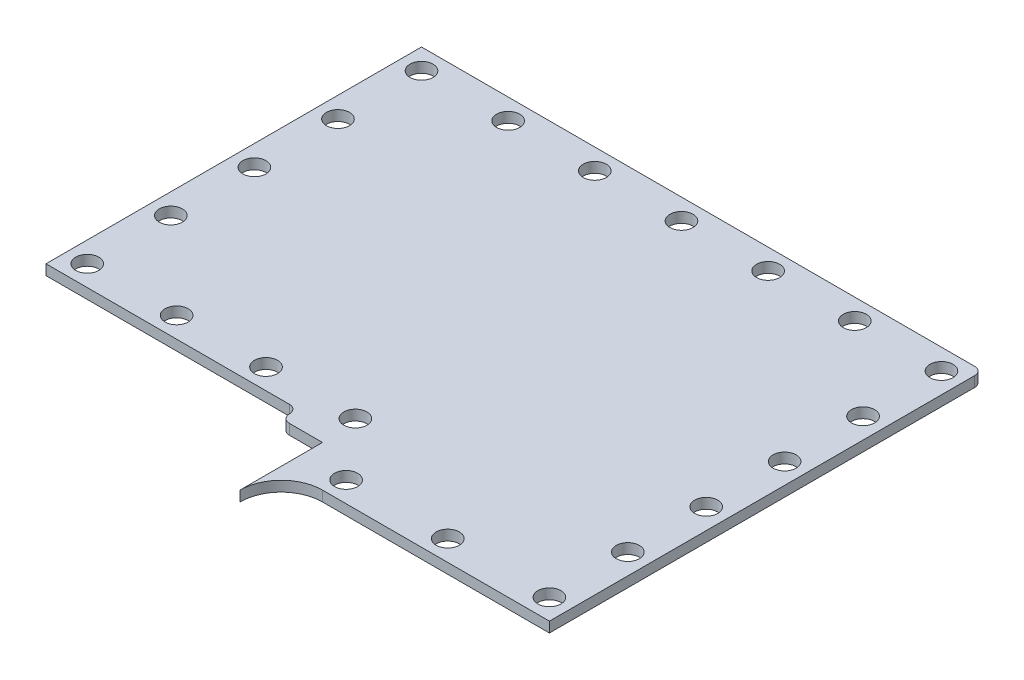
ISO-10303-21;
HEADER;
FILE_DESCRIPTION(('STEP AP214'),'2;1');
FILE_NAME('part.step','',(''),(''),'','','');
FILE_SCHEMA(('AUTOMOTIVE_DESIGN { 1 0 10303 214 1 1 1 1 }'));
ENDSEC;
DATA;
#1=APPLICATION_CONTEXT('core data for automotive mechanical design processes');
#2=APPLICATION_PROTOCOL_DEFINITION('international standard','automotive_design',2000,#1);
#3=PRODUCT_CONTEXT('',#1,'mechanical');
#4=PRODUCT('Part','Part','',(#3));
#5=PRODUCT_RELATED_PRODUCT_CATEGORY('part','',(#4));
#6=PRODUCT_DEFINITION_FORMATION('','',#4);
#7=PRODUCT_DEFINITION_CONTEXT('part definition',#1,'design');
#8=PRODUCT_DEFINITION('design','',#6,#7);
#9=PRODUCT_DEFINITION_SHAPE('','',#8);
#10=(LENGTH_UNIT() NAMED_UNIT(*) SI_UNIT(.MILLI.,.METRE.));
#11=(NAMED_UNIT(*) PLANE_ANGLE_UNIT() SI_UNIT($,.RADIAN.));
#12=(NAMED_UNIT(*) SI_UNIT($,.STERADIAN.) SOLID_ANGLE_UNIT());
#13=UNCERTAINTY_MEASURE_WITH_UNIT(LENGTH_MEASURE(1.E-05),#10,'distance_accuracy_value','');
#14=(GEOMETRIC_REPRESENTATION_CONTEXT(3) GLOBAL_UNCERTAINTY_ASSIGNED_CONTEXT((#13)) GLOBAL_UNIT_ASSIGNED_CONTEXT((#10,
#11,#12)) REPRESENTATION_CONTEXT('',''));
#15=CARTESIAN_POINT('',(0.,0.,0.));
#16=DIRECTION('',(0.,0.,1.));
#17=DIRECTION('',(1.,0.,0.));
#18=AXIS2_PLACEMENT_3D('',#15,#16,#17);
#19=CARTESIAN_POINT('',(8.88999999999993,1.5875,73.025));
#20=DIRECTION('',(0.,-1.,0.));
#21=DIRECTION('',(0.,0.,-1.));
#22=AXIS2_PLACEMENT_3D('',#19,#20,#21);
#23=CYLINDRICAL_SURFACE('',#22,6.34999999999999);
#24=CARTESIAN_POINT('',(8.88999999999993,0.,73.025));
#25=DIRECTION('',(0.,-1.,0.));
#26=DIRECTION('',(0.,0.,1.));
#27=AXIS2_PLACEMENT_3D('',#24,#25,#26);
#28=CIRCLE('',#27,6.34999999999999);
#29=CARTESIAN_POINT('',(2.53999999999993,0.,73.025));
#30=VERTEX_POINT('',#29);
#31=CARTESIAN_POINT('',(8.8899999999999,0.,66.675));
#32=VERTEX_POINT('',#31);
#33=EDGE_CURVE('E157',#30,#32,#28,.T.);
#34=ORIENTED_EDGE('',*,*,#33,.T.);
#35=DIRECTION('',(0.,-1.,0.));
#36=VECTOR('',#35,1.);
#37=CARTESIAN_POINT('',(8.8899999999999,1.5875,66.675));
#38=LINE('',#37,#36);
#39=CARTESIAN_POINT('',(8.8899999999999,1.5875,66.675));
#40=VERTEX_POINT('',#39);
#41=EDGE_CURVE('E11',#40,#32,#38,.T.);
#42=ORIENTED_EDGE('',*,*,#41,.F.);
#43=CARTESIAN_POINT('',(8.88999999999993,1.5875,73.025));
#44=DIRECTION('',(0.,-1.,0.));
#45=DIRECTION('',(0.,0.,1.));
#46=AXIS2_PLACEMENT_3D('',#43,#44,#45);
#47=CIRCLE('',#46,6.34999999999999);
#48=CARTESIAN_POINT('',(2.53999999999993,1.5875,73.025));
#49=VERTEX_POINT('',#48);
#50=EDGE_CURVE('E189',#49,#40,#47,.T.);
#51=ORIENTED_EDGE('',*,*,#50,.F.);
#52=DIRECTION('',(0.,-1.,0.));
#53=VECTOR('',#52,1.);
#54=CARTESIAN_POINT('',(2.53999999999993,1.5875,73.025));
#55=LINE('',#54,#53);
#56=EDGE_CURVE('E153',#49,#30,#55,.T.);
#57=ORIENTED_EDGE('',*,*,#56,.T.);
#58=EDGE_LOOP('',(#34,#42,#51,#57));
#59=FACE_BOUND('',#58,.T.);
#60=ADVANCED_FACE('F38',(#59),#23,.F.);
#61=CARTESIAN_POINT('',(8.8899999999999,1.5875,66.675));
#62=DIRECTION('',(0.,0.,-1.));
#63=DIRECTION('',(-1.,0.,0.));
#64=AXIS2_PLACEMENT_3D('',#61,#62,#63);
#65=PLANE('',#64);
#66=DIRECTION('',(1.,0.,0.));
#67=VECTOR('',#66,1.);
#68=CARTESIAN_POINT('',(8.8899999999999,0.,66.675));
#69=LINE('',#68,#67);
#70=CARTESIAN_POINT('',(43.815,0.,66.675));
#71=VERTEX_POINT('',#70);
#72=EDGE_CURVE('E161',#32,#71,#69,.T.);
#73=ORIENTED_EDGE('',*,*,#72,.T.);
#74=DIRECTION('',(0.,-1.,0.));
#75=VECTOR('',#74,1.);
#76=CARTESIAN_POINT('',(43.815,1.5875,66.675));
#77=LINE('',#76,#75);
#78=CARTESIAN_POINT('',(43.815,1.5875,66.675));
#79=VERTEX_POINT('',#78);
#80=EDGE_CURVE('E47',#79,#71,#77,.T.);
#81=ORIENTED_EDGE('',*,*,#80,.F.);
#82=DIRECTION('',(1.,0.,0.));
#83=VECTOR('',#82,1.);
#84=CARTESIAN_POINT('',(8.8899999999999,1.5875,66.675));
#85=LINE('',#84,#83);
#86=EDGE_CURVE('E107',#40,#79,#85,.T.);
#87=ORIENTED_EDGE('',*,*,#86,.F.);
#88=ORIENTED_EDGE('',*,*,#41,.T.);
#89=EDGE_LOOP('',(#73,#81,#87,#88));
#90=FACE_BOUND('',#89,.T.);
#91=ADVANCED_FACE('F277',(#90),#65,.F.);
#92=CARTESIAN_POINT('',(43.815,1.5875,66.675));
#93=DIRECTION('',(-1.,0.,0.));
#94=DIRECTION('',(0.,0.,1.));
#95=AXIS2_PLACEMENT_3D('',#92,#93,#94);
#96=PLANE('',#95);
#97=DIRECTION('',(0.,0.,-1.));
#98=VECTOR('',#97,1.);
#99=CARTESIAN_POINT('',(43.815,0.,66.675));
#100=LINE('',#99,#98);
#101=CARTESIAN_POINT('',(43.815,0.,1.26999999999999));
#102=VERTEX_POINT('',#101);
#103=EDGE_CURVE('E165',#71,#102,#100,.T.);
#104=ORIENTED_EDGE('',*,*,#103,.T.);
#105=DIRECTION('',(0.,-1.,0.));
#106=VECTOR('',#105,1.);
#107=CARTESIAN_POINT('',(43.815,1.5875,1.26999999999999));
#108=LINE('',#107,#106);
#109=CARTESIAN_POINT('',(43.815,1.5875,1.26999999999999));
#110=VERTEX_POINT('',#109);
#111=EDGE_CURVE('E212',#110,#102,#108,.T.);
#112=ORIENTED_EDGE('',*,*,#111,.F.);
#113=DIRECTION('',(0.,0.,-1.));
#114=VECTOR('',#113,1.);
#115=CARTESIAN_POINT('',(43.815,1.5875,66.675));
#116=LINE('',#115,#114);
#117=EDGE_CURVE('E222',#79,#110,#116,.T.);
#118=ORIENTED_EDGE('',*,*,#117,.F.);
#119=ORIENTED_EDGE('',*,*,#80,.T.);
#120=EDGE_LOOP('',(#104,#112,#118,#119));
#121=FACE_BOUND('',#120,.T.);
#122=ADVANCED_FACE('F220',(#121),#96,.F.);
#123=CARTESIAN_POINT('',(42.5796667647193,1.5875,1.23533323528069));
#124=DIRECTION('',(0.,-1.,0.));
#125=DIRECTION('',(0.,0.,-1.));
#126=AXIS2_PLACEMENT_3D('',#123,#124,#125);
#127=CYLINDRICAL_SURFACE('',#126,1.23581956076328);
#128=CARTESIAN_POINT('',(42.5796667647193,0.,1.23533323528069));
#129=DIRECTION('',(0.,1.,0.));
#130=DIRECTION('',(0.,0.,1.));
#131=AXIS2_PLACEMENT_3D('',#128,#129,#130);
#132=CIRCLE('',#131,1.23581956076328);
#133=CARTESIAN_POINT('',(42.545,0.,0.));
#134=VERTEX_POINT('',#133);
#135=EDGE_CURVE('E168',#102,#134,#132,.T.);
#136=ORIENTED_EDGE('',*,*,#135,.T.);
#137=DIRECTION('',(0.,-1.,0.));
#138=VECTOR('',#137,1.);
#139=CARTESIAN_POINT('',(42.545,1.5875,0.));
#140=LINE('',#139,#138);
#141=CARTESIAN_POINT('',(42.545,1.5875,0.));
#142=VERTEX_POINT('',#141);
#143=EDGE_CURVE('E208',#142,#134,#140,.T.);
#144=ORIENTED_EDGE('',*,*,#143,.F.);
#145=CARTESIAN_POINT('',(42.5796667647193,1.5875,1.23533323528069));
#146=DIRECTION('',(0.,1.,0.));
#147=DIRECTION('',(0.,0.,1.));
#148=AXIS2_PLACEMENT_3D('',#145,#146,#147);
#149=CIRCLE('',#148,1.23581956076328);
#150=EDGE_CURVE('E241',#110,#142,#149,.T.);
#151=ORIENTED_EDGE('',*,*,#150,.F.);
#152=ORIENTED_EDGE('',*,*,#111,.T.);
#153=EDGE_LOOP('',(#136,#144,#151,#152));
#154=FACE_BOUND('',#153,.T.);
#155=ADVANCED_FACE('F231',(#154),#127,.T.);
#156=CARTESIAN_POINT('',(42.545,1.5875,0.));
#157=DIRECTION('',(0.,0.,1.));
#158=DIRECTION('',(1.,0.,0.));
#159=AXIS2_PLACEMENT_3D('',#156,#157,#158);
#160=PLANE('',#159);
#161=DIRECTION('',(-1.,0.,0.));
#162=VECTOR('',#161,1.);
#163=CARTESIAN_POINT('',(42.545,0.,0.));
#164=LINE('',#163,#162);
#165=CARTESIAN_POINT('',(-42.545,0.,0.));
#166=VERTEX_POINT('',#165);
#167=EDGE_CURVE('E171',#134,#166,#164,.T.);
#168=ORIENTED_EDGE('',*,*,#167,.T.);
#169=DIRECTION('',(0.,-1.,0.));
#170=VECTOR('',#169,1.);
#171=CARTESIAN_POINT('',(-42.545,1.5875,0.));
#172=LINE('',#171,#170);
#173=CARTESIAN_POINT('',(-42.545,1.5875,0.));
#174=VERTEX_POINT('',#173);
#175=EDGE_CURVE('E204',#174,#166,#172,.T.);
#176=ORIENTED_EDGE('',*,*,#175,.F.);
#177=DIRECTION('',(-1.,0.,0.));
#178=VECTOR('',#177,1.);
#179=CARTESIAN_POINT('',(42.545,1.5875,0.));
#180=LINE('',#179,#178);
#181=EDGE_CURVE('E237',#142,#174,#180,.T.);
#182=ORIENTED_EDGE('',*,*,#181,.F.);
#183=ORIENTED_EDGE('',*,*,#143,.T.);
#184=EDGE_LOOP('',(#168,#176,#182,#183));
#185=FACE_BOUND('',#184,.T.);
#186=ADVANCED_FACE('F235',(#185),#160,.F.);
#187=CARTESIAN_POINT('',(-42.545,1.5875,0.));
#188=DIRECTION('',(1.,0.,0.));
#189=DIRECTION('',(0.,0.,-1.));
#190=AXIS2_PLACEMENT_3D('',#187,#188,#189);
#191=PLANE('',#190);
#192=DIRECTION('',(0.,0.,1.));
#193=VECTOR('',#192,1.);
#194=CARTESIAN_POINT('',(-42.545,0.,0.));
#195=LINE('',#194,#193);
#196=CARTESIAN_POINT('',(-42.5450000000002,0.,57.785));
#197=VERTEX_POINT('',#196);
#198=EDGE_CURVE('E174',#166,#197,#195,.T.);
#199=ORIENTED_EDGE('',*,*,#198,.T.);
#200=DIRECTION('',(0.,-1.,0.));
#201=VECTOR('',#200,1.);
#202=CARTESIAN_POINT('',(-42.5450000000002,1.5875,57.785));
#203=LINE('',#202,#201);
#204=CARTESIAN_POINT('',(-42.5450000000002,1.5875,57.785));
#205=VERTEX_POINT('',#204);
#206=EDGE_CURVE('E200',#205,#197,#203,.T.);
#207=ORIENTED_EDGE('',*,*,#206,.F.);
#208=DIRECTION('',(0.,0.,1.));
#209=VECTOR('',#208,1.);
#210=CARTESIAN_POINT('',(-42.545,1.5875,0.));
#211=LINE('',#210,#209);
#212=EDGE_CURVE('E240',#174,#205,#211,.T.);
#213=ORIENTED_EDGE('',*,*,#212,.F.);
#214=ORIENTED_EDGE('',*,*,#175,.T.);
#215=EDGE_LOOP('',(#199,#207,#213,#214));
#216=FACE_BOUND('',#215,.T.);
#217=ADVANCED_FACE('F290',(#216),#191,.F.);
#218=CARTESIAN_POINT('',(-42.5450000000002,1.5875,57.785));
#219=DIRECTION('',(0.,0.,-1.));
#220=DIRECTION('',(-1.,0.,0.));
#221=AXIS2_PLACEMENT_3D('',#218,#219,#220);
#222=PLANE('',#221);
#223=DIRECTION('',(1.,0.,0.));
#224=VECTOR('',#223,1.);
#225=CARTESIAN_POINT('',(-42.5450000000002,0.,57.785));
#226=LINE('',#225,#224);
#227=CARTESIAN_POINT('',(-5.08000000000022,0.,57.785));
#228=VERTEX_POINT('',#227);
#229=EDGE_CURVE('E177',#197,#228,#226,.T.);
#230=ORIENTED_EDGE('',*,*,#229,.T.);
#231=DIRECTION('',(0.,-1.,0.));
#232=VECTOR('',#231,1.);
#233=CARTESIAN_POINT('',(-5.08000000000022,1.5875,57.785));
#234=LINE('',#233,#232);
#235=CARTESIAN_POINT('',(-5.08000000000022,1.5875,57.785));
#236=VERTEX_POINT('',#235);
#237=EDGE_CURVE('E196',#236,#228,#234,.T.);
#238=ORIENTED_EDGE('',*,*,#237,.F.);
#239=DIRECTION('',(1.,0.,0.));
#240=VECTOR('',#239,1.);
#241=CARTESIAN_POINT('',(-42.5450000000002,1.5875,57.785));
#242=LINE('',#241,#240);
#243=EDGE_CURVE('E245',#205,#236,#242,.T.);
#244=ORIENTED_EDGE('',*,*,#243,.F.);
#245=ORIENTED_EDGE('',*,*,#206,.T.);
#246=EDGE_LOOP('',(#230,#238,#244,#245));
#247=FACE_BOUND('',#246,.T.);
#248=ADVANCED_FACE('F256',(#247),#222,.F.);
#249=CARTESIAN_POINT('',(-5.08000000000022,1.5875,59.055));
#250=DIRECTION('',(0.,-1.,0.));
#251=DIRECTION('',(0.,0.,-1.));
#252=AXIS2_PLACEMENT_3D('',#249,#250,#251);
#253=CYLINDRICAL_SURFACE('',#252,1.26999999999999);
#254=CARTESIAN_POINT('',(-5.08000000000022,0.,59.055));
#255=DIRECTION('',(0.,-1.,0.));
#256=DIRECTION('',(0.,0.,-1.));
#257=AXIS2_PLACEMENT_3D('',#254,#255,#256);
#258=CIRCLE('',#257,1.26999999999999);
#259=CARTESIAN_POINT('',(-3.81000000000023,0.,59.0550000000001));
#260=VERTEX_POINT('',#259);
#261=EDGE_CURVE('E180',#228,#260,#258,.T.);
#262=ORIENTED_EDGE('',*,*,#261,.T.);
#263=DIRECTION('',(0.,-1.,0.));
#264=VECTOR('',#263,1.);
#265=CARTESIAN_POINT('',(-3.81000000000023,1.5875,59.0550000000001));
#266=LINE('',#265,#264);
#267=CARTESIAN_POINT('',(-3.81000000000023,1.5875,59.0550000000001));
#268=VERTEX_POINT('',#267);
#269=EDGE_CURVE('E146',#268,#260,#266,.T.);
#270=ORIENTED_EDGE('',*,*,#269,.F.);
#271=CARTESIAN_POINT('',(-5.08000000000022,1.5875,59.055));
#272=DIRECTION('',(0.,-1.,0.));
#273=DIRECTION('',(0.,0.,-1.));
#274=AXIS2_PLACEMENT_3D('',#271,#272,#273);
#275=CIRCLE('',#274,1.26999999999999);
#276=EDGE_CURVE('E135',#236,#268,#275,.T.);
#277=ORIENTED_EDGE('',*,*,#276,.F.);
#278=ORIENTED_EDGE('',*,*,#237,.T.);
#279=EDGE_LOOP('',(#262,#270,#277,#278));
#280=FACE_BOUND('',#279,.T.);
#281=ADVANCED_FACE('F260',(#280),#253,.F.);
#282=CARTESIAN_POINT('',(-2.54000000000024,1.5875,59.0550000000001));
#283=DIRECTION('',(0.,-1.,0.));
#284=DIRECTION('',(0.,0.,-1.));
#285=AXIS2_PLACEMENT_3D('',#282,#283,#284);
#286=CYLINDRICAL_SURFACE('',#285,1.27);
#287=CARTESIAN_POINT('',(-2.54000000000024,0.,59.0550000000001));
#288=DIRECTION('',(0.,1.,0.));
#289=DIRECTION('',(0.,0.,1.));
#290=AXIS2_PLACEMENT_3D('',#287,#288,#289);
#291=CIRCLE('',#290,1.27);
#292=CARTESIAN_POINT('',(-2.54000000000024,0.,60.3250000000001));
#293=VERTEX_POINT('',#292);
#294=EDGE_CURVE('E144',#260,#293,#291,.T.);
#295=ORIENTED_EDGE('',*,*,#294,.T.);
#296=DIRECTION('',(0.,-1.,0.));
#297=VECTOR('',#296,1.);
#298=CARTESIAN_POINT('',(-2.54000000000024,1.5875,60.3250000000001));
#299=LINE('',#298,#297);
#300=CARTESIAN_POINT('',(-2.54000000000024,1.5875,60.3250000000001));
#301=VERTEX_POINT('',#300);
#302=EDGE_CURVE('E141',#301,#293,#299,.T.);
#303=ORIENTED_EDGE('',*,*,#302,.F.);
#304=CARTESIAN_POINT('',(-2.54000000000024,1.5875,59.0550000000001));
#305=DIRECTION('',(0.,1.,0.));
#306=DIRECTION('',(0.,0.,1.));
#307=AXIS2_PLACEMENT_3D('',#304,#305,#306);
#308=CIRCLE('',#307,1.27);
#309=EDGE_CURVE('E129',#268,#301,#308,.T.);
#310=ORIENTED_EDGE('',*,*,#309,.F.);
#311=ORIENTED_EDGE('',*,*,#269,.T.);
#312=EDGE_LOOP('',(#295,#303,#310,#311));
#313=FACE_BOUND('',#312,.T.);
#314=ADVANCED_FACE('F142',(#313),#286,.T.);
#315=CARTESIAN_POINT('',(-2.54000000000022,1.5875,60.3250000000001));
#316=DIRECTION('',(0.,0.,-1.));
#317=DIRECTION('',(-1.,0.,0.));
#318=AXIS2_PLACEMENT_3D('',#315,#316,#317);
#319=PLANE('',#318);
#320=DIRECTION('',(1.,0.,0.));
#321=VECTOR('',#320,1.);
#322=CARTESIAN_POINT('',(-2.54000000000022,0.,60.3250000000001));
#323=LINE('',#322,#321);
#324=CARTESIAN_POINT('',(2.53999999999993,0.,60.325));
#325=VERTEX_POINT('',#324);
#326=EDGE_CURVE('E93',#293,#325,#323,.T.);
#327=ORIENTED_EDGE('',*,*,#326,.T.);
#328=DIRECTION('',(0.,-1.,0.));
#329=VECTOR('',#328,1.);
#330=CARTESIAN_POINT('',(2.53999999999993,1.5875,60.325));
#331=LINE('',#330,#329);
#332=CARTESIAN_POINT('',(2.53999999999993,1.5875,60.325));
#333=VERTEX_POINT('',#332);
#334=EDGE_CURVE('E147',#333,#325,#331,.T.);
#335=ORIENTED_EDGE('',*,*,#334,.F.);
#336=DIRECTION('',(1.,0.,0.));
#337=VECTOR('',#336,1.);
#338=CARTESIAN_POINT('',(-2.54000000000022,1.5875,60.3250000000001));
#339=LINE('',#338,#337);
#340=EDGE_CURVE('E133',#301,#333,#339,.T.);
#341=ORIENTED_EDGE('',*,*,#340,.F.);
#342=ORIENTED_EDGE('',*,*,#302,.T.);
#343=EDGE_LOOP('',(#327,#335,#341,#342));
#344=FACE_BOUND('',#343,.T.);
#345=ADVANCED_FACE('F149',(#344),#319,.F.);
#346=CARTESIAN_POINT('',(2.53999999999993,1.5875,60.325));
#347=DIRECTION('',(1.,0.,0.));
#348=DIRECTION('',(0.,0.,-1.));
#349=AXIS2_PLACEMENT_3D('',#346,#347,#348);
#350=PLANE('',#349);
#351=DIRECTION('',(0.,0.,1.));
#352=VECTOR('',#351,1.);
#353=CARTESIAN_POINT('',(2.53999999999993,0.,60.325));
#354=LINE('',#353,#352);
#355=EDGE_CURVE('E99',#325,#30,#354,.T.);
#356=ORIENTED_EDGE('',*,*,#355,.T.);
#357=ORIENTED_EDGE('',*,*,#56,.F.);
#358=DIRECTION('',(0.,0.,1.));
#359=VECTOR('',#358,1.);
#360=CARTESIAN_POINT('',(2.53999999999993,1.5875,60.325));
#361=LINE('',#360,#359);
#362=EDGE_CURVE('E55',#333,#49,#361,.T.);
#363=ORIENTED_EDGE('',*,*,#362,.F.);
#364=ORIENTED_EDGE('',*,*,#334,.T.);
#365=EDGE_LOOP('',(#356,#357,#363,#364));
#366=FACE_BOUND('',#365,.T.);
#367=ADVANCED_FACE('F264',(#366),#350,.F.);
#368=CARTESIAN_POINT('',(8.88999999999993,1.5875,73.025));
#369=DIRECTION('',(0.,1.,0.));
#370=DIRECTION('',(0.,0.,1.));
#371=AXIS2_PLACEMENT_3D('',#368,#369,#370);
#372=PLANE('',#371);
#373=CARTESIAN_POINT('',(9.34880947261776,1.5875,63.5));
#374=DIRECTION('',(0.,1.,0.));
#375=DIRECTION('',(0.,0.,1.));
#376=AXIS2_PLACEMENT_3D('',#373,#374,#375);
#377=CIRCLE('',#376,1.778);
#378=CARTESIAN_POINT('',(9.34880947261776,1.5875,65.278));
#379=VERTEX_POINT('',#378);
#380=EDGE_CURVE('E162',#379,#379,#377,.T.);
#381=ORIENTED_EDGE('',*,*,#380,.F.);
#382=EDGE_LOOP('',(#381));
#383=FACE_BOUND('',#382,.T.);
#384=CARTESIAN_POINT('',(24.9944047363089,1.5875,63.4999999999999));
#385=DIRECTION('',(0.,1.,0.));
#386=DIRECTION('',(0.,0.,1.));
#387=AXIS2_PLACEMENT_3D('',#384,#385,#386);
#388=CIRCLE('',#387,1.778);
#389=CARTESIAN_POINT('',(24.9944047363089,1.5875,65.2779999999999));
#390=VERTEX_POINT('',#389);
#391=EDGE_CURVE('E667',#390,#390,#388,.T.);
#392=ORIENTED_EDGE('',*,*,#391,.F.);
#393=EDGE_LOOP('',(#392));
#394=FACE_BOUND('',#393,.T.);
#395=CARTESIAN_POINT('',(40.64,1.5875,63.4999999999999));
#396=DIRECTION('',(0.,1.,0.));
#397=DIRECTION('',(0.,0.,1.));
#398=AXIS2_PLACEMENT_3D('',#395,#396,#397);
#399=CIRCLE('',#398,1.778);
#400=CARTESIAN_POINT('',(40.64,1.5875,65.2779999999999));
#401=VERTEX_POINT('',#400);
#402=EDGE_CURVE('E663',#401,#401,#399,.T.);
#403=ORIENTED_EDGE('',*,*,#402,.F.);
#404=EDGE_LOOP('',(#403));
#405=FACE_BOUND('',#404,.T.);
#406=CARTESIAN_POINT('',(40.6399999999999,1.5875,51.4349999999999));
#407=DIRECTION('',(0.,1.,0.));
#408=DIRECTION('',(0.,0.,1.));
#409=AXIS2_PLACEMENT_3D('',#406,#407,#408);
#410=CIRCLE('',#409,1.778);
#411=CARTESIAN_POINT('',(40.6399999999999,1.5875,53.2129999999999));
#412=VERTEX_POINT('',#411);
#413=EDGE_CURVE('E659',#412,#412,#410,.T.);
#414=ORIENTED_EDGE('',*,*,#413,.F.);
#415=EDGE_LOOP('',(#414));
#416=FACE_BOUND('',#415,.T.);
#417=CARTESIAN_POINT('',(-39.3699999999999,1.5875,41.75125));
#418=DIRECTION('',(0.,1.,0.));
#419=DIRECTION('',(0.,0.,1.));
#420=AXIS2_PLACEMENT_3D('',#417,#418,#419);
#421=CIRCLE('',#420,1.778);
#422=CARTESIAN_POINT('',(-39.3699999999999,1.5875,43.52925));
#423=VERTEX_POINT('',#422);
#424=EDGE_CURVE('E655',#423,#423,#421,.T.);
#425=ORIENTED_EDGE('',*,*,#424,.F.);
#426=EDGE_LOOP('',(#425));
#427=FACE_BOUND('',#426,.T.);
#428=CARTESIAN_POINT('',(40.6399999999998,1.5875,15.24));
#429=DIRECTION('',(0.,1.,0.));
#430=DIRECTION('',(0.,0.,1.));
#431=AXIS2_PLACEMENT_3D('',#428,#429,#430);
#432=CIRCLE('',#431,1.778);
#433=CARTESIAN_POINT('',(40.6399999999998,1.5875,17.018));
#434=VERTEX_POINT('',#433);
#435=EDGE_CURVE('E651',#434,#434,#432,.T.);
#436=ORIENTED_EDGE('',*,*,#435,.F.);
#437=EDGE_LOOP('',(#436));
#438=FACE_BOUND('',#437,.T.);
#439=CARTESIAN_POINT('',(40.6399999999999,1.5875,27.305));
#440=DIRECTION('',(0.,1.,0.));
#441=DIRECTION('',(0.,0.,1.));
#442=AXIS2_PLACEMENT_3D('',#439,#440,#441);
#443=CIRCLE('',#442,1.778);
#444=CARTESIAN_POINT('',(40.6399999999999,1.5875,29.083));
#445=VERTEX_POINT('',#444);
#446=EDGE_CURVE('E647',#445,#445,#443,.T.);
#447=ORIENTED_EDGE('',*,*,#446,.F.);
#448=EDGE_LOOP('',(#447));
#449=FACE_BOUND('',#448,.T.);
#450=CARTESIAN_POINT('',(40.6399999999999,1.5875,39.3699999999999));
#451=DIRECTION('',(0.,1.,0.));
#452=DIRECTION('',(0.,0.,1.));
#453=AXIS2_PLACEMENT_3D('',#450,#451,#452);
#454=CIRCLE('',#453,1.778);
#455=CARTESIAN_POINT('',(40.6399999999999,1.5875,41.1479999999999));
#456=VERTEX_POINT('',#455);
#457=EDGE_CURVE('E643',#456,#456,#454,.T.);
#458=ORIENTED_EDGE('',*,*,#457,.F.);
#459=EDGE_LOOP('',(#458));
#460=FACE_BOUND('',#459,.T.);
#461=CARTESIAN_POINT('',(-26.0350000000001,1.5875,3.1749999999999));
#462=DIRECTION('',(0.,1.,0.));
#463=DIRECTION('',(0.,0.,1.));
#464=AXIS2_PLACEMENT_3D('',#461,#462,#463);
#465=CIRCLE('',#464,1.778);
#466=CARTESIAN_POINT('',(-26.0350000000001,1.5875,4.9529999999999));
#467=VERTEX_POINT('',#466);
#468=EDGE_CURVE('E639',#467,#467,#465,.T.);
#469=ORIENTED_EDGE('',*,*,#468,.F.);
#470=EDGE_LOOP('',(#469));
#471=FACE_BOUND('',#470,.T.);
#472=CARTESIAN_POINT('',(-12.7000000000001,1.5875,3.17499999999981));
#473=DIRECTION('',(0.,1.,0.));
#474=DIRECTION('',(0.,0.,1.));
#475=AXIS2_PLACEMENT_3D('',#472,#473,#474);
#476=CIRCLE('',#475,1.778);
#477=CARTESIAN_POINT('',(-12.7000000000001,1.5875,4.95299999999981));
#478=VERTEX_POINT('',#477);
#479=EDGE_CURVE('E635',#478,#478,#476,.T.);
#480=ORIENTED_EDGE('',*,*,#479,.F.);
#481=EDGE_LOOP('',(#480));
#482=FACE_BOUND('',#481,.T.);
#483=CARTESIAN_POINT('',(0.634999999999789,1.5875,3.17499999999972));
#484=DIRECTION('',(0.,1.,0.));
#485=DIRECTION('',(0.,0.,1.));
#486=AXIS2_PLACEMENT_3D('',#483,#484,#485);
#487=CIRCLE('',#486,1.778);
#488=CARTESIAN_POINT('',(0.634999999999789,1.5875,4.95299999999972));
#489=VERTEX_POINT('',#488);
#490=EDGE_CURVE('E631',#489,#489,#487,.T.);
#491=ORIENTED_EDGE('',*,*,#490,.F.);
#492=EDGE_LOOP('',(#491));
#493=FACE_BOUND('',#492,.T.);
#494=CARTESIAN_POINT('',(13.9699999999997,1.5875,3.17499999999962));
#495=DIRECTION('',(0.,1.,0.));
#496=DIRECTION('',(0.,0.,1.));
#497=AXIS2_PLACEMENT_3D('',#494,#495,#496);
#498=CIRCLE('',#497,1.778);
#499=CARTESIAN_POINT('',(13.9699999999997,1.5875,4.95299999999962));
#500=VERTEX_POINT('',#499);
#501=EDGE_CURVE('E627',#500,#500,#498,.T.);
#502=ORIENTED_EDGE('',*,*,#501,.F.);
#503=EDGE_LOOP('',(#502));
#504=FACE_BOUND('',#503,.T.);
#505=CARTESIAN_POINT('',(27.3049999999996,1.5875,3.17499999999953));
#506=DIRECTION('',(0.,1.,0.));
#507=DIRECTION('',(0.,0.,1.));
#508=AXIS2_PLACEMENT_3D('',#505,#506,#507);
#509=CIRCLE('',#508,1.778);
#510=CARTESIAN_POINT('',(27.3049999999996,1.5875,4.95299999999953));
#511=VERTEX_POINT('',#510);
#512=EDGE_CURVE('E623',#511,#511,#509,.T.);
#513=ORIENTED_EDGE('',*,*,#512,.F.);
#514=EDGE_LOOP('',(#513));
#515=FACE_BOUND('',#514,.T.);
#516=CARTESIAN_POINT('',(40.6399999999996,1.5875,3.17499999999963));
#517=DIRECTION('',(0.,1.,0.));
#518=DIRECTION('',(0.,0.,1.));
#519=AXIS2_PLACEMENT_3D('',#516,#517,#518);
#520=CIRCLE('',#519,1.778);
#521=CARTESIAN_POINT('',(40.6399999999996,1.5875,4.95299999999963));
#522=VERTEX_POINT('',#521);
#523=EDGE_CURVE('E619',#522,#522,#520,.T.);
#524=ORIENTED_EDGE('',*,*,#523,.F.);
#525=EDGE_LOOP('',(#524));
#526=FACE_BOUND('',#525,.T.);
#527=CARTESIAN_POINT('',(-39.37,1.5875,16.03375));
#528=DIRECTION('',(0.,1.,0.));
#529=DIRECTION('',(0.,0.,1.));
#530=AXIS2_PLACEMENT_3D('',#527,#528,#529);
#531=CIRCLE('',#530,1.778);
#532=CARTESIAN_POINT('',(-39.37,1.5875,17.81175));
#533=VERTEX_POINT('',#532);
#534=EDGE_CURVE('E615',#533,#533,#531,.T.);
#535=ORIENTED_EDGE('',*,*,#534,.F.);
#536=EDGE_LOOP('',(#535));
#537=FACE_BOUND('',#536,.T.);
#538=CARTESIAN_POINT('',(-39.3699999999999,1.5875,28.8925));
#539=DIRECTION('',(0.,1.,0.));
#540=DIRECTION('',(0.,0.,1.));
#541=AXIS2_PLACEMENT_3D('',#538,#539,#540);
#542=CIRCLE('',#541,1.778);
#543=CARTESIAN_POINT('',(-39.3699999999999,1.5875,30.6705));
#544=VERTEX_POINT('',#543);
#545=EDGE_CURVE('E611',#544,#544,#542,.T.);
#546=ORIENTED_EDGE('',*,*,#545,.F.);
#547=EDGE_LOOP('',(#546));
#548=FACE_BOUND('',#547,.T.);
#549=CARTESIAN_POINT('',(1.88921375145161,1.5875,54.6099999999999));
#550=DIRECTION('',(0.,1.,0.));
#551=DIRECTION('',(0.,0.,1.));
#552=AXIS2_PLACEMENT_3D('',#549,#550,#551);
#553=CIRCLE('',#552,1.778);
#554=CARTESIAN_POINT('',(1.88921375145161,1.5875,56.3879999999999));
#555=VERTEX_POINT('',#554);
#556=EDGE_CURVE('E607',#555,#555,#553,.T.);
#557=ORIENTED_EDGE('',*,*,#556,.F.);
#558=EDGE_LOOP('',(#557));
#559=FACE_BOUND('',#558,.T.);
#560=CARTESIAN_POINT('',(-11.8638574990322,1.5875,54.6099999999999));
#561=DIRECTION('',(0.,1.,0.));
#562=DIRECTION('',(0.,0.,1.));
#563=AXIS2_PLACEMENT_3D('',#560,#561,#562);
#564=CIRCLE('',#563,1.778);
#565=CARTESIAN_POINT('',(-11.8638574990322,1.5875,56.3879999999999));
#566=VERTEX_POINT('',#565);
#567=EDGE_CURVE('E603',#566,#566,#564,.T.);
#568=ORIENTED_EDGE('',*,*,#567,.F.);
#569=EDGE_LOOP('',(#568));
#570=FACE_BOUND('',#569,.T.);
#571=CARTESIAN_POINT('',(-25.616928749516,1.5875,54.6099999999999));
#572=DIRECTION('',(0.,1.,0.));
#573=DIRECTION('',(0.,0.,1.));
#574=AXIS2_PLACEMENT_3D('',#571,#572,#573);
#575=CIRCLE('',#574,1.778);
#576=CARTESIAN_POINT('',(-25.616928749516,1.5875,56.3879999999999));
#577=VERTEX_POINT('',#576);
#578=EDGE_CURVE('E599',#577,#577,#575,.T.);
#579=ORIENTED_EDGE('',*,*,#578,.F.);
#580=EDGE_LOOP('',(#579));
#581=FACE_BOUND('',#580,.T.);
#582=CARTESIAN_POINT('',(-39.3699999999998,1.5875,54.61));
#583=DIRECTION('',(0.,1.,0.));
#584=DIRECTION('',(0.,0.,1.));
#585=AXIS2_PLACEMENT_3D('',#582,#583,#584);
#586=CIRCLE('',#585,1.778);
#587=CARTESIAN_POINT('',(-39.3699999999998,1.5875,56.388));
#588=VERTEX_POINT('',#587);
#589=EDGE_CURVE('E595',#588,#588,#586,.T.);
#590=ORIENTED_EDGE('',*,*,#589,.F.);
#591=EDGE_LOOP('',(#590));
#592=FACE_BOUND('',#591,.T.);
#593=CARTESIAN_POINT('',(-39.37,1.5875,3.175));
#594=DIRECTION('',(0.,1.,0.));
#595=DIRECTION('',(0.,0.,1.));
#596=AXIS2_PLACEMENT_3D('',#593,#594,#595);
#597=CIRCLE('',#596,1.778);
#598=CARTESIAN_POINT('',(-39.37,1.5875,4.953));
#599=VERTEX_POINT('',#598);
#600=EDGE_CURVE('E591',#599,#599,#597,.T.);
#601=ORIENTED_EDGE('',*,*,#600,.F.);
#602=EDGE_LOOP('',(#601));
#603=FACE_BOUND('',#602,.T.);
#604=ORIENTED_EDGE('',*,*,#50,.T.);
#605=ORIENTED_EDGE('',*,*,#86,.T.);
#606=ORIENTED_EDGE('',*,*,#117,.T.);
#607=ORIENTED_EDGE('',*,*,#150,.T.);
#608=ORIENTED_EDGE('',*,*,#181,.T.);
#609=ORIENTED_EDGE('',*,*,#212,.T.);
#610=ORIENTED_EDGE('',*,*,#243,.T.);
#611=ORIENTED_EDGE('',*,*,#276,.T.);
#612=ORIENTED_EDGE('',*,*,#309,.T.);
#613=ORIENTED_EDGE('',*,*,#340,.T.);
#614=ORIENTED_EDGE('',*,*,#362,.T.);
#615=EDGE_LOOP('',(#604,#605,#606,#607,#608,#609,#610,#611,#612,#613,#614));
#616=FACE_BOUND('',#615,.T.);
#617=ADVANCED_FACE('F131',(#383,#394,#405,#416,#427,#438,#449,#460,#471,#482,#493,#504,#515,
#526,#537,#548,#559,#570,#581,#592,#603,#616),#372,.T.);
#618=CARTESIAN_POINT('',(8.88999999999993,0.,73.025));
#619=DIRECTION('',(0.,1.,0.));
#620=DIRECTION('',(0.,0.,1.));
#621=AXIS2_PLACEMENT_3D('',#618,#619,#620);
#622=PLANE('',#621);
#623=CARTESIAN_POINT('',(9.34880947261776,0.,63.5));
#624=DIRECTION('',(0.,1.,0.));
#625=DIRECTION('',(0.,0.,1.));
#626=AXIS2_PLACEMENT_3D('',#623,#624,#625);
#627=CIRCLE('',#626,1.778);
#628=CARTESIAN_POINT('',(9.34880947261776,0.,65.278));
#629=VERTEX_POINT('',#628);
#630=EDGE_CURVE('E539',#629,#629,#627,.T.);
#631=ORIENTED_EDGE('',*,*,#630,.T.);
#632=EDGE_LOOP('',(#631));
#633=FACE_BOUND('',#632,.T.);
#634=CARTESIAN_POINT('',(24.9944047363089,0.,63.4999999999999));
#635=DIRECTION('',(0.,1.,0.));
#636=DIRECTION('',(0.,0.,1.));
#637=AXIS2_PLACEMENT_3D('',#634,#635,#636);
#638=CIRCLE('',#637,1.778);
#639=CARTESIAN_POINT('',(24.9944047363089,0.,65.2779999999999));
#640=VERTEX_POINT('',#639);
#641=EDGE_CURVE('E541',#640,#640,#638,.T.);
#642=ORIENTED_EDGE('',*,*,#641,.T.);
#643=EDGE_LOOP('',(#642));
#644=FACE_BOUND('',#643,.T.);
#645=CARTESIAN_POINT('',(40.64,0.,63.4999999999999));
#646=DIRECTION('',(0.,1.,0.));
#647=DIRECTION('',(0.,0.,1.));
#648=AXIS2_PLACEMENT_3D('',#645,#646,#647);
#649=CIRCLE('',#648,1.778);
#650=CARTESIAN_POINT('',(40.64,0.,65.2779999999999));
#651=VERTEX_POINT('',#650);
#652=EDGE_CURVE('E547',#651,#651,#649,.T.);
#653=ORIENTED_EDGE('',*,*,#652,.T.);
#654=EDGE_LOOP('',(#653));
#655=FACE_BOUND('',#654,.T.);
#656=CARTESIAN_POINT('',(40.6399999999999,0.,51.4349999999999));
#657=DIRECTION('',(0.,1.,0.));
#658=DIRECTION('',(0.,0.,1.));
#659=AXIS2_PLACEMENT_3D('',#656,#657,#658);
#660=CIRCLE('',#659,1.778);
#661=CARTESIAN_POINT('',(40.6399999999999,0.,53.2129999999999));
#662=VERTEX_POINT('',#661);
#663=EDGE_CURVE('E692',#662,#662,#660,.T.);
#664=ORIENTED_EDGE('',*,*,#663,.T.);
#665=EDGE_LOOP('',(#664));
#666=FACE_BOUND('',#665,.T.);
#667=CARTESIAN_POINT('',(-39.3699999999999,0.,41.75125));
#668=DIRECTION('',(0.,1.,0.));
#669=DIRECTION('',(0.,0.,1.));
#670=AXIS2_PLACEMENT_3D('',#667,#668,#669);
#671=CIRCLE('',#670,1.778);
#672=CARTESIAN_POINT('',(-39.3699999999999,0.,43.52925));
#673=VERTEX_POINT('',#672);
#674=EDGE_CURVE('E571',#673,#673,#671,.T.);
#675=ORIENTED_EDGE('',*,*,#674,.T.);
#676=EDGE_LOOP('',(#675));
#677=FACE_BOUND('',#676,.T.);
#678=CARTESIAN_POINT('',(40.6399999999998,0.,15.24));
#679=DIRECTION('',(0.,1.,0.));
#680=DIRECTION('',(0.,0.,1.));
#681=AXIS2_PLACEMENT_3D('',#678,#679,#680);
#682=CIRCLE('',#681,1.778);
#683=CARTESIAN_POINT('',(40.6399999999998,0.,17.018));
#684=VERTEX_POINT('',#683);
#685=EDGE_CURVE('E680',#684,#684,#682,.T.);
#686=ORIENTED_EDGE('',*,*,#685,.T.);
#687=EDGE_LOOP('',(#686));
#688=FACE_BOUND('',#687,.T.);
#689=CARTESIAN_POINT('',(40.6399999999999,0.,27.305));
#690=DIRECTION('',(0.,1.,0.));
#691=DIRECTION('',(0.,0.,1.));
#692=AXIS2_PLACEMENT_3D('',#689,#690,#691);
#693=CIRCLE('',#692,1.778);
#694=CARTESIAN_POINT('',(40.6399999999999,0.,29.083));
#695=VERTEX_POINT('',#694);
#696=EDGE_CURVE('E684',#695,#695,#693,.T.);
#697=ORIENTED_EDGE('',*,*,#696,.T.);
#698=EDGE_LOOP('',(#697));
#699=FACE_BOUND('',#698,.T.);
#700=CARTESIAN_POINT('',(40.6399999999999,0.,39.3699999999999));
#701=DIRECTION('',(0.,1.,0.));
#702=DIRECTION('',(0.,0.,1.));
#703=AXIS2_PLACEMENT_3D('',#700,#701,#702);
#704=CIRCLE('',#703,1.778);
#705=CARTESIAN_POINT('',(40.6399999999999,0.,41.1479999999999));
#706=VERTEX_POINT('',#705);
#707=EDGE_CURVE('E688',#706,#706,#704,.T.);
#708=ORIENTED_EDGE('',*,*,#707,.T.);
#709=EDGE_LOOP('',(#708));
#710=FACE_BOUND('',#709,.T.);
#711=CARTESIAN_POINT('',(-26.0350000000001,0.,3.1749999999999));
#712=DIRECTION('',(0.,1.,0.));
#713=DIRECTION('',(0.,0.,1.));
#714=AXIS2_PLACEMENT_3D('',#711,#712,#713);
#715=CIRCLE('',#714,1.778);
#716=CARTESIAN_POINT('',(-26.0350000000001,0.,4.9529999999999));
#717=VERTEX_POINT('',#716);
#718=EDGE_CURVE('E572',#717,#717,#715,.T.);
#719=ORIENTED_EDGE('',*,*,#718,.T.);
#720=EDGE_LOOP('',(#719));
#721=FACE_BOUND('',#720,.T.);
#722=CARTESIAN_POINT('',(-12.7000000000001,0.,3.17499999999981));
#723=DIRECTION('',(0.,1.,0.));
#724=DIRECTION('',(0.,0.,1.));
#725=AXIS2_PLACEMENT_3D('',#722,#723,#724);
#726=CIRCLE('',#725,1.778);
#727=CARTESIAN_POINT('',(-12.7000000000001,0.,4.95299999999981));
#728=VERTEX_POINT('',#727);
#729=EDGE_CURVE('E577',#728,#728,#726,.T.);
#730=ORIENTED_EDGE('',*,*,#729,.T.);
#731=EDGE_LOOP('',(#730));
#732=FACE_BOUND('',#731,.T.);
#733=CARTESIAN_POINT('',(0.634999999999789,0.,3.17499999999972));
#734=DIRECTION('',(0.,1.,0.));
#735=DIRECTION('',(0.,0.,1.));
#736=AXIS2_PLACEMENT_3D('',#733,#734,#735);
#737=CIRCLE('',#736,1.778);
#738=CARTESIAN_POINT('',(0.634999999999789,0.,4.95299999999972));
#739=VERTEX_POINT('',#738);
#740=EDGE_CURVE('E581',#739,#739,#737,.T.);
#741=ORIENTED_EDGE('',*,*,#740,.T.);
#742=EDGE_LOOP('',(#741));
#743=FACE_BOUND('',#742,.T.);
#744=CARTESIAN_POINT('',(13.9699999999997,0.,3.17499999999962));
#745=DIRECTION('',(0.,1.,0.));
#746=DIRECTION('',(0.,0.,1.));
#747=AXIS2_PLACEMENT_3D('',#744,#745,#746);
#748=CIRCLE('',#747,1.778);
#749=CARTESIAN_POINT('',(13.9699999999997,0.,4.95299999999962));
#750=VERTEX_POINT('',#749);
#751=EDGE_CURVE('E558',#750,#750,#748,.T.);
#752=ORIENTED_EDGE('',*,*,#751,.T.);
#753=EDGE_LOOP('',(#752));
#754=FACE_BOUND('',#753,.T.);
#755=CARTESIAN_POINT('',(27.3049999999996,0.,3.17499999999953));
#756=DIRECTION('',(0.,1.,0.));
#757=DIRECTION('',(0.,0.,1.));
#758=AXIS2_PLACEMENT_3D('',#755,#756,#757);
#759=CIRCLE('',#758,1.778);
#760=CARTESIAN_POINT('',(27.3049999999996,0.,4.95299999999953));
#761=VERTEX_POINT('',#760);
#762=EDGE_CURVE('E554',#761,#761,#759,.T.);
#763=ORIENTED_EDGE('',*,*,#762,.T.);
#764=EDGE_LOOP('',(#763));
#765=FACE_BOUND('',#764,.T.);
#766=CARTESIAN_POINT('',(40.6399999999996,0.,3.17499999999963));
#767=DIRECTION('',(0.,1.,0.));
#768=DIRECTION('',(0.,0.,1.));
#769=AXIS2_PLACEMENT_3D('',#766,#767,#768);
#770=CIRCLE('',#769,1.778);
#771=CARTESIAN_POINT('',(40.6399999999996,0.,4.95299999999963));
#772=VERTEX_POINT('',#771);
#773=EDGE_CURVE('E559',#772,#772,#770,.T.);
#774=ORIENTED_EDGE('',*,*,#773,.T.);
#775=EDGE_LOOP('',(#774));
#776=FACE_BOUND('',#775,.T.);
#777=CARTESIAN_POINT('',(-39.37,0.,16.03375));
#778=DIRECTION('',(0.,1.,0.));
#779=DIRECTION('',(0.,0.,1.));
#780=AXIS2_PLACEMENT_3D('',#777,#778,#779);
#781=CIRCLE('',#780,1.778);
#782=CARTESIAN_POINT('',(-39.37,0.,17.81175));
#783=VERTEX_POINT('',#782);
#784=EDGE_CURVE('E563',#783,#783,#781,.T.);
#785=ORIENTED_EDGE('',*,*,#784,.T.);
#786=EDGE_LOOP('',(#785));
#787=FACE_BOUND('',#786,.T.);
#788=CARTESIAN_POINT('',(-39.3699999999999,0.,28.8925));
#789=DIRECTION('',(0.,1.,0.));
#790=DIRECTION('',(0.,0.,1.));
#791=AXIS2_PLACEMENT_3D('',#788,#789,#790);
#792=CIRCLE('',#791,1.778);
#793=CARTESIAN_POINT('',(-39.3699999999999,0.,30.6705));
#794=VERTEX_POINT('',#793);
#795=EDGE_CURVE('E567',#794,#794,#792,.T.);
#796=ORIENTED_EDGE('',*,*,#795,.T.);
#797=EDGE_LOOP('',(#796));
#798=FACE_BOUND('',#797,.T.);
#799=CARTESIAN_POINT('',(1.88921375145161,0.,54.6099999999999));
#800=DIRECTION('',(0.,1.,0.));
#801=DIRECTION('',(0.,0.,1.));
#802=AXIS2_PLACEMENT_3D('',#799,#800,#801);
#803=CIRCLE('',#802,1.778);
#804=CARTESIAN_POINT('',(1.88921375145161,0.,56.3879999999999));
#805=VERTEX_POINT('',#804);
#806=EDGE_CURVE('E542',#805,#805,#803,.T.);
#807=ORIENTED_EDGE('',*,*,#806,.T.);
#808=EDGE_LOOP('',(#807));
#809=FACE_BOUND('',#808,.T.);
#810=CARTESIAN_POINT('',(-11.8638574990322,0.,54.6099999999999));
#811=DIRECTION('',(0.,1.,0.));
#812=DIRECTION('',(0.,0.,1.));
#813=AXIS2_PLACEMENT_3D('',#810,#811,#812);
#814=CIRCLE('',#813,1.778);
#815=CARTESIAN_POINT('',(-11.8638574990322,0.,56.3879999999999));
#816=VERTEX_POINT('',#815);
#817=EDGE_CURVE('E550',#816,#816,#814,.T.);
#818=ORIENTED_EDGE('',*,*,#817,.T.);
#819=EDGE_LOOP('',(#818));
#820=FACE_BOUND('',#819,.T.);
#821=CARTESIAN_POINT('',(-25.616928749516,0.,54.6099999999999));
#822=DIRECTION('',(0.,1.,0.));
#823=DIRECTION('',(0.,0.,1.));
#824=AXIS2_PLACEMENT_3D('',#821,#822,#823);
#825=CIRCLE('',#824,1.778);
#826=CARTESIAN_POINT('',(-25.616928749516,0.,56.3879999999999));
#827=VERTEX_POINT('',#826);
#828=EDGE_CURVE('E705',#827,#827,#825,.T.);
#829=ORIENTED_EDGE('',*,*,#828,.T.);
#830=EDGE_LOOP('',(#829));
#831=FACE_BOUND('',#830,.T.);
#832=CARTESIAN_POINT('',(-39.3699999999998,0.,54.61));
#833=DIRECTION('',(0.,1.,0.));
#834=DIRECTION('',(0.,0.,1.));
#835=AXIS2_PLACEMENT_3D('',#832,#833,#834);
#836=CIRCLE('',#835,1.778);
#837=CARTESIAN_POINT('',(-39.3699999999998,0.,56.388));
#838=VERTEX_POINT('',#837);
#839=EDGE_CURVE('E701',#838,#838,#836,.T.);
#840=ORIENTED_EDGE('',*,*,#839,.T.);
#841=EDGE_LOOP('',(#840));
#842=FACE_BOUND('',#841,.T.);
#843=CARTESIAN_POINT('',(-39.37,0.,3.175));
#844=DIRECTION('',(0.,1.,0.));
#845=DIRECTION('',(0.,0.,1.));
#846=AXIS2_PLACEMENT_3D('',#843,#844,#845);
#847=CIRCLE('',#846,1.778);
#848=CARTESIAN_POINT('',(-39.37,0.,4.953));
#849=VERTEX_POINT('',#848);
#850=EDGE_CURVE('E576',#849,#849,#847,.T.);
#851=ORIENTED_EDGE('',*,*,#850,.T.);
#852=EDGE_LOOP('',(#851));
#853=FACE_BOUND('',#852,.T.);
#854=ORIENTED_EDGE('',*,*,#33,.F.);
#855=ORIENTED_EDGE('',*,*,#355,.F.);
#856=ORIENTED_EDGE('',*,*,#326,.F.);
#857=ORIENTED_EDGE('',*,*,#294,.F.);
#858=ORIENTED_EDGE('',*,*,#261,.F.);
#859=ORIENTED_EDGE('',*,*,#229,.F.);
#860=ORIENTED_EDGE('',*,*,#198,.F.);
#861=ORIENTED_EDGE('',*,*,#167,.F.);
#862=ORIENTED_EDGE('',*,*,#135,.F.);
#863=ORIENTED_EDGE('',*,*,#103,.F.);
#864=ORIENTED_EDGE('',*,*,#72,.F.);
#865=EDGE_LOOP('',(#854,#855,#856,#857,#858,#859,#860,#861,#862,#863,#864));
#866=FACE_BOUND('',#865,.T.);
#867=ADVANCED_FACE('F226',(#633,#644,#655,#666,#677,#688,#699,#710,#721,#732,#743,#754,#765,
#776,#787,#798,#809,#820,#831,#842,#853,#866),#622,.F.);
#868=CARTESIAN_POINT('',(-39.37,0.,3.175));
#869=DIRECTION('',(0.,1.,0.));
#870=DIRECTION('',(0.,0.,1.));
#871=AXIS2_PLACEMENT_3D('',#868,#869,#870);
#872=CYLINDRICAL_SURFACE('',#871,1.778);
#873=ORIENTED_EDGE('',*,*,#600,.T.);
#874=EDGE_LOOP('',(#873));
#875=FACE_BOUND('',#874,.T.);
#876=ORIENTED_EDGE('',*,*,#850,.F.);
#877=EDGE_LOOP('',(#876));
#878=FACE_BOUND('',#877,.T.);
#879=ADVANCED_FACE('F322',(#875,#878),#872,.F.);
#880=CARTESIAN_POINT('',(-39.3699999999998,0.,54.61));
#881=DIRECTION('',(0.,1.,0.));
#882=DIRECTION('',(0.,0.,1.));
#883=AXIS2_PLACEMENT_3D('',#880,#881,#882);
#884=CYLINDRICAL_SURFACE('',#883,1.778);
#885=ORIENTED_EDGE('',*,*,#589,.T.);
#886=EDGE_LOOP('',(#885));
#887=FACE_BOUND('',#886,.T.);
#888=ORIENTED_EDGE('',*,*,#839,.F.);
#889=EDGE_LOOP('',(#888));
#890=FACE_BOUND('',#889,.T.);
#891=ADVANCED_FACE('F330',(#887,#890),#884,.F.);
#892=CARTESIAN_POINT('',(-25.616928749516,0.,54.6099999999999));
#893=DIRECTION('',(0.,1.,0.));
#894=DIRECTION('',(0.,0.,1.));
#895=AXIS2_PLACEMENT_3D('',#892,#893,#894);
#896=CYLINDRICAL_SURFACE('',#895,1.778);
#897=ORIENTED_EDGE('',*,*,#578,.T.);
#898=EDGE_LOOP('',(#897));
#899=FACE_BOUND('',#898,.T.);
#900=ORIENTED_EDGE('',*,*,#828,.F.);
#901=EDGE_LOOP('',(#900));
#902=FACE_BOUND('',#901,.T.);
#903=ADVANCED_FACE('F340',(#899,#902),#896,.F.);
#904=CARTESIAN_POINT('',(-11.8638574990322,0.,54.6099999999999));
#905=DIRECTION('',(0.,1.,0.));
#906=DIRECTION('',(0.,0.,1.));
#907=AXIS2_PLACEMENT_3D('',#904,#905,#906);
#908=CYLINDRICAL_SURFACE('',#907,1.778);
#909=ORIENTED_EDGE('',*,*,#567,.T.);
#910=EDGE_LOOP('',(#909));
#911=FACE_BOUND('',#910,.T.);
#912=ORIENTED_EDGE('',*,*,#817,.F.);
#913=EDGE_LOOP('',(#912));
#914=FACE_BOUND('',#913,.T.);
#915=ADVANCED_FACE('F350',(#911,#914),#908,.F.);
#916=CARTESIAN_POINT('',(1.88921375145161,0.,54.6099999999999));
#917=DIRECTION('',(0.,1.,0.));
#918=DIRECTION('',(0.,0.,1.));
#919=AXIS2_PLACEMENT_3D('',#916,#917,#918);
#920=CYLINDRICAL_SURFACE('',#919,1.778);
#921=ORIENTED_EDGE('',*,*,#556,.T.);
#922=EDGE_LOOP('',(#921));
#923=FACE_BOUND('',#922,.T.);
#924=ORIENTED_EDGE('',*,*,#806,.F.);
#925=EDGE_LOOP('',(#924));
#926=FACE_BOUND('',#925,.T.);
#927=ADVANCED_FACE('F360',(#923,#926),#920,.F.);
#928=CARTESIAN_POINT('',(-39.3699999999999,0.,28.8925));
#929=DIRECTION('',(0.,1.,0.));
#930=DIRECTION('',(0.,0.,1.));
#931=AXIS2_PLACEMENT_3D('',#928,#929,#930);
#932=CYLINDRICAL_SURFACE('',#931,1.778);
#933=ORIENTED_EDGE('',*,*,#545,.T.);
#934=EDGE_LOOP('',(#933));
#935=FACE_BOUND('',#934,.T.);
#936=ORIENTED_EDGE('',*,*,#795,.F.);
#937=EDGE_LOOP('',(#936));
#938=FACE_BOUND('',#937,.T.);
#939=ADVANCED_FACE('F370',(#935,#938),#932,.F.);
#940=CARTESIAN_POINT('',(-39.37,0.,16.03375));
#941=DIRECTION('',(0.,1.,0.));
#942=DIRECTION('',(0.,0.,1.));
#943=AXIS2_PLACEMENT_3D('',#940,#941,#942);
#944=CYLINDRICAL_SURFACE('',#943,1.778);
#945=ORIENTED_EDGE('',*,*,#534,.T.);
#946=EDGE_LOOP('',(#945));
#947=FACE_BOUND('',#946,.T.);
#948=ORIENTED_EDGE('',*,*,#784,.F.);
#949=EDGE_LOOP('',(#948));
#950=FACE_BOUND('',#949,.T.);
#951=ADVANCED_FACE('F380',(#947,#950),#944,.F.);
#952=CARTESIAN_POINT('',(40.6399999999996,0.,3.17499999999963));
#953=DIRECTION('',(0.,1.,0.));
#954=DIRECTION('',(0.,0.,1.));
#955=AXIS2_PLACEMENT_3D('',#952,#953,#954);
#956=CYLINDRICAL_SURFACE('',#955,1.778);
#957=ORIENTED_EDGE('',*,*,#523,.T.);
#958=EDGE_LOOP('',(#957));
#959=FACE_BOUND('',#958,.T.);
#960=ORIENTED_EDGE('',*,*,#773,.F.);
#961=EDGE_LOOP('',(#960));
#962=FACE_BOUND('',#961,.T.);
#963=ADVANCED_FACE('F390',(#959,#962),#956,.F.);
#964=CARTESIAN_POINT('',(27.3049999999996,0.,3.17499999999953));
#965=DIRECTION('',(0.,1.,0.));
#966=DIRECTION('',(0.,0.,1.));
#967=AXIS2_PLACEMENT_3D('',#964,#965,#966);
#968=CYLINDRICAL_SURFACE('',#967,1.778);
#969=ORIENTED_EDGE('',*,*,#512,.T.);
#970=EDGE_LOOP('',(#969));
#971=FACE_BOUND('',#970,.T.);
#972=ORIENTED_EDGE('',*,*,#762,.F.);
#973=EDGE_LOOP('',(#972));
#974=FACE_BOUND('',#973,.T.);
#975=ADVANCED_FACE('F400',(#971,#974),#968,.F.);
#976=CARTESIAN_POINT('',(13.9699999999997,0.,3.17499999999962));
#977=DIRECTION('',(0.,1.,0.));
#978=DIRECTION('',(0.,0.,1.));
#979=AXIS2_PLACEMENT_3D('',#976,#977,#978);
#980=CYLINDRICAL_SURFACE('',#979,1.778);
#981=ORIENTED_EDGE('',*,*,#501,.T.);
#982=EDGE_LOOP('',(#981));
#983=FACE_BOUND('',#982,.T.);
#984=ORIENTED_EDGE('',*,*,#751,.F.);
#985=EDGE_LOOP('',(#984));
#986=FACE_BOUND('',#985,.T.);
#987=ADVANCED_FACE('F410',(#983,#986),#980,.F.);
#988=CARTESIAN_POINT('',(0.634999999999789,0.,3.17499999999972));
#989=DIRECTION('',(0.,1.,0.));
#990=DIRECTION('',(0.,0.,1.));
#991=AXIS2_PLACEMENT_3D('',#988,#989,#990);
#992=CYLINDRICAL_SURFACE('',#991,1.778);
#993=ORIENTED_EDGE('',*,*,#490,.T.);
#994=EDGE_LOOP('',(#993));
#995=FACE_BOUND('',#994,.T.);
#996=ORIENTED_EDGE('',*,*,#740,.F.);
#997=EDGE_LOOP('',(#996));
#998=FACE_BOUND('',#997,.T.);
#999=ADVANCED_FACE('F420',(#995,#998),#992,.F.);
#1000=CARTESIAN_POINT('',(-12.7000000000001,0.,3.17499999999981));
#1001=DIRECTION('',(0.,1.,0.));
#1002=DIRECTION('',(0.,0.,1.));
#1003=AXIS2_PLACEMENT_3D('',#1000,#1001,#1002);
#1004=CYLINDRICAL_SURFACE('',#1003,1.778);
#1005=ORIENTED_EDGE('',*,*,#479,.T.);
#1006=EDGE_LOOP('',(#1005));
#1007=FACE_BOUND('',#1006,.T.);
#1008=ORIENTED_EDGE('',*,*,#729,.F.);
#1009=EDGE_LOOP('',(#1008));
#1010=FACE_BOUND('',#1009,.T.);
#1011=ADVANCED_FACE('F430',(#1007,#1010),#1004,.F.);
#1012=CARTESIAN_POINT('',(-26.0350000000001,0.,3.1749999999999));
#1013=DIRECTION('',(0.,1.,0.));
#1014=DIRECTION('',(0.,0.,1.));
#1015=AXIS2_PLACEMENT_3D('',#1012,#1013,#1014);
#1016=CYLINDRICAL_SURFACE('',#1015,1.778);
#1017=ORIENTED_EDGE('',*,*,#468,.T.);
#1018=EDGE_LOOP('',(#1017));
#1019=FACE_BOUND('',#1018,.T.);
#1020=ORIENTED_EDGE('',*,*,#718,.F.);
#1021=EDGE_LOOP('',(#1020));
#1022=FACE_BOUND('',#1021,.T.);
#1023=ADVANCED_FACE('F440',(#1019,#1022),#1016,.F.);
#1024=CARTESIAN_POINT('',(40.6399999999999,0.,39.3699999999999));
#1025=DIRECTION('',(0.,1.,0.));
#1026=DIRECTION('',(0.,0.,1.));
#1027=AXIS2_PLACEMENT_3D('',#1024,#1025,#1026);
#1028=CYLINDRICAL_SURFACE('',#1027,1.778);
#1029=ORIENTED_EDGE('',*,*,#457,.T.);
#1030=EDGE_LOOP('',(#1029));
#1031=FACE_BOUND('',#1030,.T.);
#1032=ORIENTED_EDGE('',*,*,#707,.F.);
#1033=EDGE_LOOP('',(#1032));
#1034=FACE_BOUND('',#1033,.T.);
#1035=ADVANCED_FACE('F450',(#1031,#1034),#1028,.F.);
#1036=CARTESIAN_POINT('',(40.6399999999999,0.,27.305));
#1037=DIRECTION('',(0.,1.,0.));
#1038=DIRECTION('',(0.,0.,1.));
#1039=AXIS2_PLACEMENT_3D('',#1036,#1037,#1038);
#1040=CYLINDRICAL_SURFACE('',#1039,1.778);
#1041=ORIENTED_EDGE('',*,*,#446,.T.);
#1042=EDGE_LOOP('',(#1041));
#1043=FACE_BOUND('',#1042,.T.);
#1044=ORIENTED_EDGE('',*,*,#696,.F.);
#1045=EDGE_LOOP('',(#1044));
#1046=FACE_BOUND('',#1045,.T.);
#1047=ADVANCED_FACE('F460',(#1043,#1046),#1040,.F.);
#1048=CARTESIAN_POINT('',(40.6399999999998,0.,15.24));
#1049=DIRECTION('',(0.,1.,0.));
#1050=DIRECTION('',(0.,0.,1.));
#1051=AXIS2_PLACEMENT_3D('',#1048,#1049,#1050);
#1052=CYLINDRICAL_SURFACE('',#1051,1.778);
#1053=ORIENTED_EDGE('',*,*,#435,.T.);
#1054=EDGE_LOOP('',(#1053));
#1055=FACE_BOUND('',#1054,.T.);
#1056=ORIENTED_EDGE('',*,*,#685,.F.);
#1057=EDGE_LOOP('',(#1056));
#1058=FACE_BOUND('',#1057,.T.);
#1059=ADVANCED_FACE('F470',(#1055,#1058),#1052,.F.);
#1060=CARTESIAN_POINT('',(-39.3699999999999,0.,41.75125));
#1061=DIRECTION('',(0.,1.,0.));
#1062=DIRECTION('',(0.,0.,1.));
#1063=AXIS2_PLACEMENT_3D('',#1060,#1061,#1062);
#1064=CYLINDRICAL_SURFACE('',#1063,1.778);
#1065=ORIENTED_EDGE('',*,*,#424,.T.);
#1066=EDGE_LOOP('',(#1065));
#1067=FACE_BOUND('',#1066,.T.);
#1068=ORIENTED_EDGE('',*,*,#674,.F.);
#1069=EDGE_LOOP('',(#1068));
#1070=FACE_BOUND('',#1069,.T.);
#1071=ADVANCED_FACE('F480',(#1067,#1070),#1064,.F.);
#1072=CARTESIAN_POINT('',(40.6399999999999,0.,51.4349999999999));
#1073=DIRECTION('',(0.,1.,0.));
#1074=DIRECTION('',(0.,0.,1.));
#1075=AXIS2_PLACEMENT_3D('',#1072,#1073,#1074);
#1076=CYLINDRICAL_SURFACE('',#1075,1.778);
#1077=ORIENTED_EDGE('',*,*,#413,.T.);
#1078=EDGE_LOOP('',(#1077));
#1079=FACE_BOUND('',#1078,.T.);
#1080=ORIENTED_EDGE('',*,*,#663,.F.);
#1081=EDGE_LOOP('',(#1080));
#1082=FACE_BOUND('',#1081,.T.);
#1083=ADVANCED_FACE('F490',(#1079,#1082),#1076,.F.);
#1084=CARTESIAN_POINT('',(40.64,0.,63.4999999999999));
#1085=DIRECTION('',(0.,1.,0.));
#1086=DIRECTION('',(0.,0.,1.));
#1087=AXIS2_PLACEMENT_3D('',#1084,#1085,#1086);
#1088=CYLINDRICAL_SURFACE('',#1087,1.778);
#1089=ORIENTED_EDGE('',*,*,#402,.T.);
#1090=EDGE_LOOP('',(#1089));
#1091=FACE_BOUND('',#1090,.T.);
#1092=ORIENTED_EDGE('',*,*,#652,.F.);
#1093=EDGE_LOOP('',(#1092));
#1094=FACE_BOUND('',#1093,.T.);
#1095=ADVANCED_FACE('F500',(#1091,#1094),#1088,.F.);
#1096=CARTESIAN_POINT('',(24.9944047363089,0.,63.4999999999999));
#1097=DIRECTION('',(0.,1.,0.));
#1098=DIRECTION('',(0.,0.,1.));
#1099=AXIS2_PLACEMENT_3D('',#1096,#1097,#1098);
#1100=CYLINDRICAL_SURFACE('',#1099,1.778);
#1101=ORIENTED_EDGE('',*,*,#391,.T.);
#1102=EDGE_LOOP('',(#1101));
#1103=FACE_BOUND('',#1102,.T.);
#1104=ORIENTED_EDGE('',*,*,#641,.F.);
#1105=EDGE_LOOP('',(#1104));
#1106=FACE_BOUND('',#1105,.T.);
#1107=ADVANCED_FACE('F510',(#1103,#1106),#1100,.F.);
#1108=CARTESIAN_POINT('',(9.34880947261776,0.,63.5));
#1109=DIRECTION('',(0.,1.,0.));
#1110=DIRECTION('',(0.,0.,1.));
#1111=AXIS2_PLACEMENT_3D('',#1108,#1109,#1110);
#1112=CYLINDRICAL_SURFACE('',#1111,1.778);
#1113=ORIENTED_EDGE('',*,*,#380,.T.);
#1114=EDGE_LOOP('',(#1113));
#1115=FACE_BOUND('',#1114,.T.);
#1116=ORIENTED_EDGE('',*,*,#630,.F.);
#1117=EDGE_LOOP('',(#1116));
#1118=FACE_BOUND('',#1117,.T.);
#1119=ADVANCED_FACE('F520',(#1115,#1118),#1112,.F.);
#1120=CLOSED_SHELL('',(#60,#91,#122,#155,#186,#217,#248,#281,#314,#345,#367,#617,#867,#879,#891,
#903,#915,#927,#939,#951,#963,#975,#987,#999,#1011,#1023,#1035,#1047,#1059,#1071,#1083,#1095,
#1107,#1119));
#1121=MANIFOLD_SOLID_BREP('B2',#1120);
#1122=ADVANCED_BREP_SHAPE_REPRESENTATION('',(#18,#1121),#14);
#1123=SHAPE_DEFINITION_REPRESENTATION(#9,#1122);
ENDSEC;
END-ISO-10303-21;
